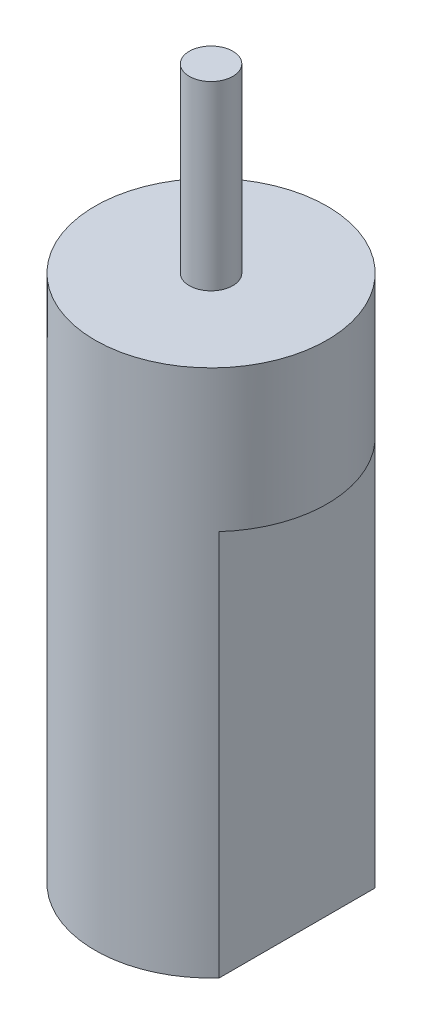
ISO-10303-21;
HEADER;
FILE_DESCRIPTION(('STEP AP214'),'2;1');
FILE_NAME('part.step','',(''),(''),'','','');
FILE_SCHEMA(('AUTOMOTIVE_DESIGN { 1 0 10303 214 1 1 1 1 }'));
ENDSEC;
DATA;
#1=APPLICATION_CONTEXT('core data for automotive mechanical design processes');
#2=APPLICATION_PROTOCOL_DEFINITION('international standard','automotive_design',2000,#1);
#3=PRODUCT_CONTEXT('',#1,'mechanical');
#4=PRODUCT('Part','Part','',(#3));
#5=PRODUCT_RELATED_PRODUCT_CATEGORY('part','',(#4));
#6=PRODUCT_DEFINITION_FORMATION('','',#4);
#7=PRODUCT_DEFINITION_CONTEXT('part definition',#1,'design');
#8=PRODUCT_DEFINITION('design','',#6,#7);
#9=PRODUCT_DEFINITION_SHAPE('','',#8);
#10=(LENGTH_UNIT() NAMED_UNIT(*) SI_UNIT(.MILLI.,.METRE.));
#11=(NAMED_UNIT(*) PLANE_ANGLE_UNIT() SI_UNIT($,.RADIAN.));
#12=(NAMED_UNIT(*) SI_UNIT($,.STERADIAN.) SOLID_ANGLE_UNIT());
#13=UNCERTAINTY_MEASURE_WITH_UNIT(LENGTH_MEASURE(1.E-05),#10,'distance_accuracy_value','');
#14=(GEOMETRIC_REPRESENTATION_CONTEXT(3) GLOBAL_UNCERTAINTY_ASSIGNED_CONTEXT((#13)) GLOBAL_UNIT_ASSIGNED_CONTEXT((#10,
#11,#12)) REPRESENTATION_CONTEXT('',''));
#15=CARTESIAN_POINT('',(0.,0.,0.));
#16=DIRECTION('',(0.,0.,1.));
#17=DIRECTION('',(1.,0.,0.));
#18=AXIS2_PLACEMENT_3D('',#15,#16,#17);
#19=CARTESIAN_POINT('',(0.,36.4236,0.));
#20=DIRECTION('',(0.,-1.,0.));
#21=DIRECTION('',(0.,0.,-1.));
#22=AXIS2_PLACEMENT_3D('',#19,#20,#21);
#23=CYLINDRICAL_SURFACE('',#22,8.);
#24=CARTESIAN_POINT('',(0.,36.4236,0.));
#25=DIRECTION('',(0.,1.,0.));
#26=DIRECTION('',(0.,0.,1.));
#27=AXIS2_PLACEMENT_3D('',#24,#25,#26);
#28=CIRCLE('',#27,8.);
#29=CARTESIAN_POINT('',(0.,36.4236,8.));
#30=VERTEX_POINT('',#29);
#31=EDGE_CURVE('E46',#30,#30,#28,.T.);
#32=ORIENTED_EDGE('',*,*,#31,.F.);
#33=EDGE_LOOP('',(#32));
#34=FACE_BOUND('',#33,.T.);
#35=CARTESIAN_POINT('',(0.,26.6446,0.));
#36=DIRECTION('',(0.,1.,0.));
#37=DIRECTION('',(0.,0.,1.));
#38=AXIS2_PLACEMENT_3D('',#35,#36,#37);
#39=CIRCLE('',#38,8.);
#40=CARTESIAN_POINT('',(5.9309,26.6446,-5.36883834642094));
#41=VERTEX_POINT('',#40);
#42=CARTESIAN_POINT('',(5.9309,26.6446,5.36883834642094));
#43=VERTEX_POINT('',#42);
#44=EDGE_CURVE('E88',#41,#43,#39,.F.);
#45=ORIENTED_EDGE('',*,*,#44,.F.);
#46=DIRECTION('',(0.,-1.,0.));
#47=VECTOR('',#46,1.);
#48=CARTESIAN_POINT('',(5.9309,47.358812644023,-5.36883834642094));
#49=LINE('',#48,#47);
#50=CARTESIAN_POINT('',(5.9309,0.,-5.36883834642094));
#51=VERTEX_POINT('',#50);
#52=EDGE_CURVE('E78',#41,#51,#49,.T.);
#53=ORIENTED_EDGE('',*,*,#52,.T.);
#54=CARTESIAN_POINT('',(0.,0.,0.));
#55=DIRECTION('',(0.,1.,0.));
#56=DIRECTION('',(0.,0.,1.));
#57=AXIS2_PLACEMENT_3D('',#54,#55,#56);
#58=CIRCLE('',#57,8.);
#59=CARTESIAN_POINT('',(-5.9309,0.,-5.36883834642094));
#60=VERTEX_POINT('',#59);
#61=EDGE_CURVE('E111',#51,#60,#58,.T.);
#62=ORIENTED_EDGE('',*,*,#61,.T.);
#63=DIRECTION('',(0.,-1.,0.));
#64=VECTOR('',#63,1.);
#65=CARTESIAN_POINT('',(-5.9309,47.358812644023,-5.36883834642094));
#66=LINE('',#65,#64);
#67=CARTESIAN_POINT('',(-5.9309,26.6446,-5.36883834642094));
#68=VERTEX_POINT('',#67);
#69=EDGE_CURVE('E54',#68,#60,#66,.T.);
#70=ORIENTED_EDGE('',*,*,#69,.F.);
#71=CARTESIAN_POINT('',(0.,26.6446,0.));
#72=DIRECTION('',(0.,1.,0.));
#73=DIRECTION('',(0.,0.,1.));
#74=AXIS2_PLACEMENT_3D('',#71,#72,#73);
#75=CIRCLE('',#74,8.);
#76=CARTESIAN_POINT('',(-5.9309,26.6446,5.36883834642094));
#77=VERTEX_POINT('',#76);
#78=EDGE_CURVE('E105',#77,#68,#75,.F.);
#79=ORIENTED_EDGE('',*,*,#78,.F.);
#80=DIRECTION('',(0.,-1.,0.));
#81=VECTOR('',#80,1.);
#82=CARTESIAN_POINT('',(-5.9309,47.358812644023,5.36883834642094));
#83=LINE('',#82,#81);
#84=CARTESIAN_POINT('',(-5.9309,0.,5.36883834642094));
#85=VERTEX_POINT('',#84);
#86=EDGE_CURVE('E104',#77,#85,#83,.T.);
#87=ORIENTED_EDGE('',*,*,#86,.T.);
#88=CARTESIAN_POINT('',(5.9309,0.,5.36883834642094));
#89=VERTEX_POINT('',#88);
#90=EDGE_CURVE('E41',#85,#89,#58,.T.);
#91=ORIENTED_EDGE('',*,*,#90,.T.);
#92=DIRECTION('',(0.,-1.,0.));
#93=VECTOR('',#92,1.);
#94=CARTESIAN_POINT('',(5.9309,47.358812644023,5.36883834642094));
#95=LINE('',#94,#93);
#96=EDGE_CURVE('E62',#43,#89,#95,.T.);
#97=ORIENTED_EDGE('',*,*,#96,.F.);
#98=EDGE_LOOP('',(#45,#53,#62,#70,#79,#87,#91,#97));
#99=FACE_BOUND('',#98,.T.);
#100=ADVANCED_FACE('F38',(#34,#99),#23,.T.);
#101=CARTESIAN_POINT('',(0.,36.4236,0.));
#102=DIRECTION('',(0.,1.,0.));
#103=DIRECTION('',(0.,0.,1.));
#104=AXIS2_PLACEMENT_3D('',#101,#102,#103);
#105=PLANE('',#104);
#106=CARTESIAN_POINT('',(0.,36.4236,0.));
#107=DIRECTION('',(0.,1.,0.));
#108=DIRECTION('',(0.,0.,1.));
#109=AXIS2_PLACEMENT_3D('',#106,#107,#108);
#110=CIRCLE('',#109,1.5);
#111=CARTESIAN_POINT('',(0.,36.4236,1.5));
#112=VERTEX_POINT('',#111);
#113=EDGE_CURVE('E12',#112,#112,#110,.T.);
#114=ORIENTED_EDGE('',*,*,#113,.F.);
#115=EDGE_LOOP('',(#114));
#116=FACE_BOUND('',#115,.T.);
#117=ORIENTED_EDGE('',*,*,#31,.T.);
#118=EDGE_LOOP('',(#117));
#119=FACE_BOUND('',#118,.T.);
#120=ADVANCED_FACE('F130',(#116,#119),#105,.T.);
#121=CARTESIAN_POINT('',(0.,0.,0.));
#122=DIRECTION('',(0.,1.,0.));
#123=DIRECTION('',(0.,0.,1.));
#124=AXIS2_PLACEMENT_3D('',#121,#122,#123);
#125=PLANE('',#124);
#126=ORIENTED_EDGE('',*,*,#61,.F.);
#127=DIRECTION('',(0.,0.,-1.));
#128=VECTOR('',#127,1.);
#129=CARTESIAN_POINT('',(5.9309,0.,5.36883834642094));
#130=LINE('',#129,#128);
#131=EDGE_CURVE('E83',#89,#51,#130,.T.);
#132=ORIENTED_EDGE('',*,*,#131,.F.);
#133=ORIENTED_EDGE('',*,*,#90,.F.);
#134=DIRECTION('',(0.,0.,1.));
#135=VECTOR('',#134,1.);
#136=CARTESIAN_POINT('',(-5.9309,0.,5.36883834642094));
#137=LINE('',#136,#135);
#138=EDGE_CURVE('E98',#60,#85,#137,.T.);
#139=ORIENTED_EDGE('',*,*,#138,.F.);
#140=EDGE_LOOP('',(#126,#132,#133,#139));
#141=FACE_BOUND('',#140,.T.);
#142=ADVANCED_FACE('F117',(#141),#125,.F.);
#143=CARTESIAN_POINT('',(0.,26.6446,0.));
#144=DIRECTION('',(0.,1.,0.));
#145=DIRECTION('',(0.,0.,1.));
#146=AXIS2_PLACEMENT_3D('',#143,#144,#145);
#147=PLANE('',#146);
#148=ORIENTED_EDGE('',*,*,#78,.T.);
#149=DIRECTION('',(0.,0.,1.));
#150=VECTOR('',#149,1.);
#151=CARTESIAN_POINT('',(-5.9309,26.6446,5.36883834642094));
#152=LINE('',#151,#150);
#153=EDGE_CURVE('E100',#68,#77,#152,.T.);
#154=ORIENTED_EDGE('',*,*,#153,.T.);
#155=EDGE_LOOP('',(#148,#154));
#156=FACE_BOUND('',#155,.T.);
#157=ADVANCED_FACE('F137',(#156),#147,.F.);
#158=CARTESIAN_POINT('',(-5.9309,47.358812644023,5.36883834642094));
#159=DIRECTION('',(1.,0.,0.));
#160=DIRECTION('',(0.,0.,-1.));
#161=AXIS2_PLACEMENT_3D('',#158,#159,#160);
#162=PLANE('',#161);
#163=ORIENTED_EDGE('',*,*,#69,.T.);
#164=ORIENTED_EDGE('',*,*,#138,.T.);
#165=ORIENTED_EDGE('',*,*,#86,.F.);
#166=ORIENTED_EDGE('',*,*,#153,.F.);
#167=EDGE_LOOP('',(#163,#164,#165,#166));
#168=FACE_BOUND('',#167,.T.);
#169=ADVANCED_FACE('F142',(#168),#162,.F.);
#170=CARTESIAN_POINT('',(0.,26.6446,0.));
#171=DIRECTION('',(0.,1.,0.));
#172=DIRECTION('',(0.,0.,1.));
#173=AXIS2_PLACEMENT_3D('',#170,#171,#172);
#174=PLANE('',#173);
#175=ORIENTED_EDGE('',*,*,#44,.T.);
#176=DIRECTION('',(0.,0.,-1.));
#177=VECTOR('',#176,1.);
#178=CARTESIAN_POINT('',(5.9309,26.6446,5.36883834642094));
#179=LINE('',#178,#177);
#180=EDGE_CURVE('E81',#43,#41,#179,.T.);
#181=ORIENTED_EDGE('',*,*,#180,.T.);
#182=EDGE_LOOP('',(#175,#181));
#183=FACE_BOUND('',#182,.T.);
#184=ADVANCED_FACE('F91',(#183),#174,.F.);
#185=CARTESIAN_POINT('',(5.9309,47.358812644023,5.36883834642094));
#186=DIRECTION('',(-1.,0.,0.));
#187=DIRECTION('',(0.,0.,1.));
#188=AXIS2_PLACEMENT_3D('',#185,#186,#187);
#189=PLANE('',#188);
#190=ORIENTED_EDGE('',*,*,#96,.T.);
#191=ORIENTED_EDGE('',*,*,#131,.T.);
#192=ORIENTED_EDGE('',*,*,#52,.F.);
#193=ORIENTED_EDGE('',*,*,#180,.F.);
#194=EDGE_LOOP('',(#190,#191,#192,#193));
#195=FACE_BOUND('',#194,.T.);
#196=ADVANCED_FACE('F80',(#195),#189,.F.);
#197=CARTESIAN_POINT('',(0.,48.9204,0.));
#198=DIRECTION('',(0.,-1.,0.));
#199=DIRECTION('',(0.,0.,-1.));
#200=AXIS2_PLACEMENT_3D('',#197,#198,#199);
#201=CYLINDRICAL_SURFACE('',#200,1.5);
#202=CARTESIAN_POINT('',(0.,48.9204,0.));
#203=DIRECTION('',(0.,1.,0.));
#204=DIRECTION('',(0.,0.,1.));
#205=AXIS2_PLACEMENT_3D('',#202,#203,#204);
#206=CIRCLE('',#205,1.5);
#207=CARTESIAN_POINT('',(0.,48.9204,1.5));
#208=VERTEX_POINT('',#207);
#209=EDGE_CURVE('E101',#208,#208,#206,.T.);
#210=ORIENTED_EDGE('',*,*,#209,.F.);
#211=EDGE_LOOP('',(#210));
#212=FACE_BOUND('',#211,.T.);
#213=ORIENTED_EDGE('',*,*,#113,.T.);
#214=EDGE_LOOP('',(#213));
#215=FACE_BOUND('',#214,.T.);
#216=ADVANCED_FACE('F124',(#212,#215),#201,.T.);
#217=CARTESIAN_POINT('',(0.,48.9204,0.));
#218=DIRECTION('',(0.,1.,0.));
#219=DIRECTION('',(0.,0.,1.));
#220=AXIS2_PLACEMENT_3D('',#217,#218,#219);
#221=PLANE('',#220);
#222=ORIENTED_EDGE('',*,*,#209,.T.);
#223=EDGE_LOOP('',(#222));
#224=FACE_BOUND('',#223,.T.);
#225=ADVANCED_FACE('F122',(#224),#221,.T.);
#226=CLOSED_SHELL('',(#100,#120,#142,#157,#169,#184,#196,#216,#225));
#227=MANIFOLD_SOLID_BREP('B2',#226);
#228=ADVANCED_BREP_SHAPE_REPRESENTATION('',(#18,#227),#14);
#229=SHAPE_DEFINITION_REPRESENTATION(#9,#228);
ENDSEC;
END-ISO-10303-21;
